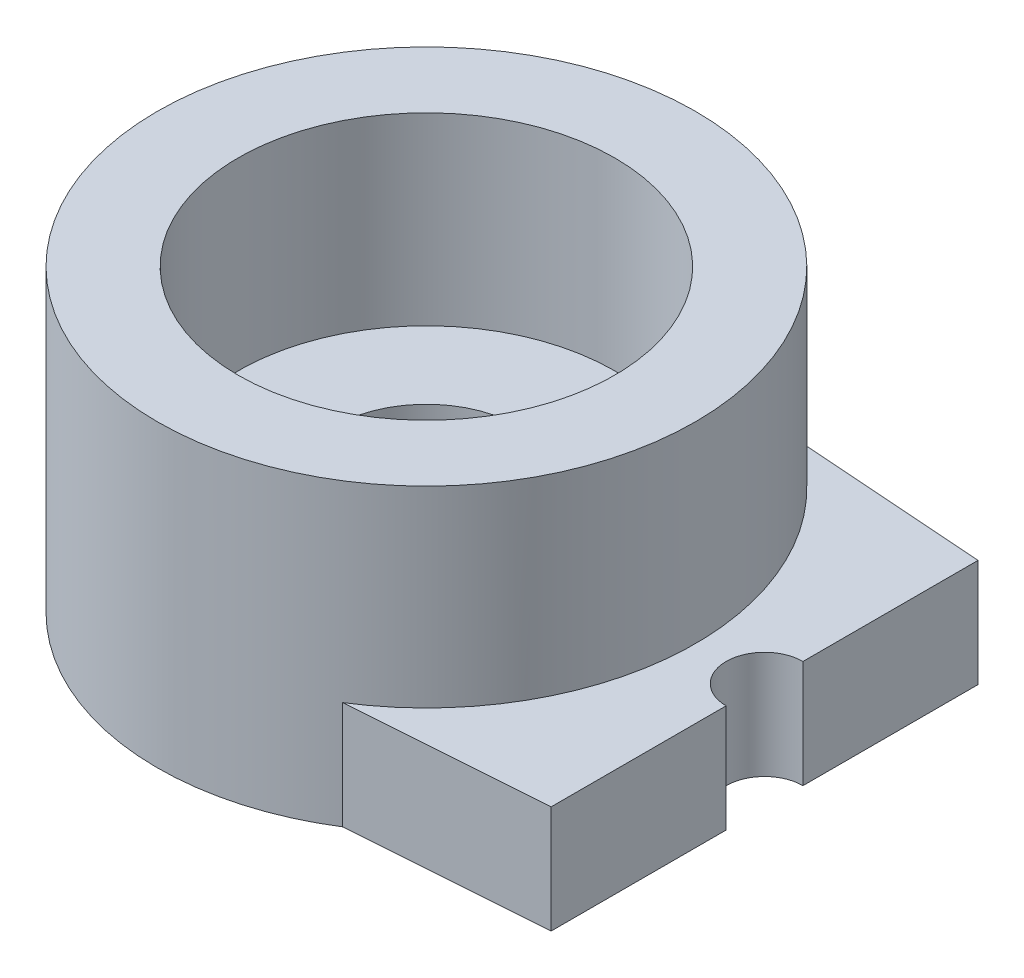
ISO-10303-21;
HEADER;
FILE_DESCRIPTION(('STEP AP214'),'2;1');
FILE_NAME('part.step','',(''),(''),'','','');
FILE_SCHEMA(('AUTOMOTIVE_DESIGN { 1 0 10303 214 1 1 1 1 }'));
ENDSEC;
DATA;
#1=APPLICATION_CONTEXT('core data for automotive mechanical design processes');
#2=APPLICATION_PROTOCOL_DEFINITION('international standard','automotive_design',2000,#1);
#3=PRODUCT_CONTEXT('',#1,'mechanical');
#4=PRODUCT('Part','Part','',(#3));
#5=PRODUCT_RELATED_PRODUCT_CATEGORY('part','',(#4));
#6=PRODUCT_DEFINITION_FORMATION('','',#4);
#7=PRODUCT_DEFINITION_CONTEXT('part definition',#1,'design');
#8=PRODUCT_DEFINITION('design','',#6,#7);
#9=PRODUCT_DEFINITION_SHAPE('','',#8);
#10=(LENGTH_UNIT() NAMED_UNIT(*) SI_UNIT(.MILLI.,.METRE.));
#11=(NAMED_UNIT(*) PLANE_ANGLE_UNIT() SI_UNIT($,.RADIAN.));
#12=(NAMED_UNIT(*) SI_UNIT($,.STERADIAN.) SOLID_ANGLE_UNIT());
#13=UNCERTAINTY_MEASURE_WITH_UNIT(LENGTH_MEASURE(1.E-05),#10,'distance_accuracy_value','');
#14=(GEOMETRIC_REPRESENTATION_CONTEXT(3) GLOBAL_UNCERTAINTY_ASSIGNED_CONTEXT((#13)) GLOBAL_UNIT_ASSIGNED_CONTEXT((#10,
#11,#12)) REPRESENTATION_CONTEXT('',''));
#15=CARTESIAN_POINT('',(0.,0.,0.));
#16=DIRECTION('',(0.,0.,1.));
#17=DIRECTION('',(1.,0.,0.));
#18=AXIS2_PLACEMENT_3D('',#15,#16,#17);
#19=CARTESIAN_POINT('',(15.2,3.9,2.));
#20=DIRECTION('',(0.0717840294641297,0.,0.997420198870011));
#21=DIRECTION('',(0.997420198870011,0.,-0.0717840294641297));
#22=AXIS2_PLACEMENT_3D('',#19,#20,#21);
#23=PLANE('',#22);
#24=DIRECTION('',(-0.997420198870011,0.,0.0717840294641296));
#25=VECTOR('',#24,1.);
#26=CARTESIAN_POINT('',(15.2,0.,2.));
#27=LINE('',#26,#25);
#28=CARTESIAN_POINT('',(4.4,0.,2.77727272727273));
#29=VERTEX_POINT('',#28);
#30=CARTESIAN_POINT('',(1.86858471289894,0.,2.95945791838985));
#31=VERTEX_POINT('',#30);
#32=EDGE_CURVE('E1068',#29,#31,#27,.T.);
#33=ORIENTED_EDGE('',*,*,#32,.F.);
#34=DIRECTION('',(0.,1.,0.));
#35=VECTOR('',#34,1.);
#36=CARTESIAN_POINT('',(4.4,3.9,2.77727272727273));
#37=LINE('',#36,#35);
#38=CARTESIAN_POINT('',(4.4,1.4,2.77727272727273));
#39=VERTEX_POINT('',#38);
#40=EDGE_CURVE('E1015',#29,#39,#37,.T.);
#41=ORIENTED_EDGE('',*,*,#40,.T.);
#42=DIRECTION('',(0.997420198870011,0.,-0.0717840294641297));
#43=VECTOR('',#42,1.);
#44=CARTESIAN_POINT('',(-14.9001527327747,1.4,4.16629887091939));
#45=LINE('',#44,#43);
#46=CARTESIAN_POINT('',(1.86858471289894,1.4,2.95945791838985));
#47=VERTEX_POINT('',#46);
#48=EDGE_CURVE('E1097',#47,#39,#45,.T.);
#49=ORIENTED_EDGE('',*,*,#48,.F.);
#50=DIRECTION('',(0.,-1.,0.));
#51=VECTOR('',#50,1.);
#52=CARTESIAN_POINT('',(1.86858471289894,3.9,2.95945791838985));
#53=LINE('',#52,#51);
#54=EDGE_CURVE('E1075',#47,#31,#53,.T.);
#55=ORIENTED_EDGE('',*,*,#54,.T.);
#56=EDGE_LOOP('',(#33,#41,#49,#55));
#57=FACE_BOUND('',#56,.T.);
#58=ADVANCED_FACE('F1006',(#57),#23,.T.);
#59=CARTESIAN_POINT('',(-15.2,1.4,0.));
#60=DIRECTION('',(0.,1.,0.));
#61=DIRECTION('',(0.,0.,1.));
#62=AXIS2_PLACEMENT_3D('',#59,#60,#61);
#63=PLANE('',#62);
#64=DIRECTION('',(0.,0.,1.));
#65=VECTOR('',#64,1.);
#66=CARTESIAN_POINT('',(4.4,1.4,0.));
#67=LINE('',#66,#65);
#68=CARTESIAN_POINT('',(4.4,1.4,-2.77727272727273));
#69=VERTEX_POINT('',#68);
#70=CARTESIAN_POINT('',(4.4,1.4,-0.499999999999929));
#71=VERTEX_POINT('',#70);
#72=EDGE_CURVE('E1085',#69,#71,#67,.T.);
#73=ORIENTED_EDGE('',*,*,#72,.F.);
#74=DIRECTION('',(-0.997420198870011,0.,-0.0717840294641295));
#75=VECTOR('',#74,1.);
#76=CARTESIAN_POINT('',(-14.9001527327747,1.4,-4.16629887091939));
#77=LINE('',#76,#75);
#78=CARTESIAN_POINT('',(1.86858471289894,1.4,-2.95945791838985));
#79=VERTEX_POINT('',#78);
#80=EDGE_CURVE('E1091',#69,#79,#77,.T.);
#81=ORIENTED_EDGE('',*,*,#80,.T.);
#82=CARTESIAN_POINT('',(0.,1.4,0.));
#83=DIRECTION('',(0.,1.,0.));
#84=DIRECTION('',(0.,0.,1.));
#85=AXIS2_PLACEMENT_3D('',#82,#83,#84);
#86=CIRCLE('',#85,3.5);
#87=EDGE_CURVE('E1109',#47,#79,#86,.T.);
#88=ORIENTED_EDGE('',*,*,#87,.F.);
#89=ORIENTED_EDGE('',*,*,#48,.T.);
#90=DIRECTION('',(0.,0.,-1.));
#91=VECTOR('',#90,1.);
#92=CARTESIAN_POINT('',(4.4,1.4,0.));
#93=LINE('',#92,#91);
#94=CARTESIAN_POINT('',(4.4,1.4,0.500000000000066));
#95=VERTEX_POINT('',#94);
#96=EDGE_CURVE('E1029',#39,#95,#93,.T.);
#97=ORIENTED_EDGE('',*,*,#96,.T.);
#98=CARTESIAN_POINT('',(4.4,1.4,0.));
#99=DIRECTION('',(0.,1.,0.));
#100=DIRECTION('',(0.,0.,1.));
#101=AXIS2_PLACEMENT_3D('',#98,#99,#100);
#102=CIRCLE('',#101,0.499999999999997);
#103=EDGE_CURVE('E1125',#71,#95,#102,.T.);
#104=ORIENTED_EDGE('',*,*,#103,.F.);
#105=EDGE_LOOP('',(#73,#81,#88,#89,#97,#104));
#106=FACE_BOUND('',#105,.T.);
#107=ADVANCED_FACE('F1164',(#106),#63,.T.);
#108=CARTESIAN_POINT('',(-15.2,0.,0.));
#109=DIRECTION('',(0.,1.,0.));
#110=DIRECTION('',(0.,0.,1.));
#111=AXIS2_PLACEMENT_3D('',#108,#109,#110);
#112=PLANE('',#111);
#113=CARTESIAN_POINT('',(0.,0.,0.));
#114=DIRECTION('',(0.,-1.,0.));
#115=DIRECTION('',(0.,0.,-1.));
#116=AXIS2_PLACEMENT_3D('',#113,#114,#115);
#117=CIRCLE('',#116,2.35);
#118=CARTESIAN_POINT('',(0.,0.,-2.35));
#119=VERTEX_POINT('',#118);
#120=EDGE_CURVE('E1114',#119,#119,#117,.T.);
#121=ORIENTED_EDGE('',*,*,#120,.F.);
#122=EDGE_LOOP('',(#121));
#123=FACE_BOUND('',#122,.T.);
#124=DIRECTION('',(0.997420198870011,0.,0.0717840294641295));
#125=VECTOR('',#124,1.);
#126=CARTESIAN_POINT('',(1.86858471289894,0.,-2.95945791838985));
#127=LINE('',#126,#125);
#128=CARTESIAN_POINT('',(1.86858471289894,0.,-2.95945791838985));
#129=VERTEX_POINT('',#128);
#130=CARTESIAN_POINT('',(4.4,0.,-2.77727272727273));
#131=VERTEX_POINT('',#130);
#132=EDGE_CURVE('E1079',#129,#131,#127,.T.);
#133=ORIENTED_EDGE('',*,*,#132,.T.);
#134=DIRECTION('',(0.,0.,-1.));
#135=VECTOR('',#134,1.);
#136=CARTESIAN_POINT('',(4.4,0.,0.));
#137=LINE('',#136,#135);
#138=CARTESIAN_POINT('',(4.4,0.,-0.499999999999929));
#139=VERTEX_POINT('',#138);
#140=EDGE_CURVE('E1021',#139,#131,#137,.T.);
#141=ORIENTED_EDGE('',*,*,#140,.F.);
#142=CARTESIAN_POINT('',(4.4,0.,0.));
#143=DIRECTION('',(0.,1.,0.));
#144=DIRECTION('',(0.,0.,1.));
#145=AXIS2_PLACEMENT_3D('',#142,#143,#144);
#146=CIRCLE('',#145,0.499999999999997);
#147=CARTESIAN_POINT('',(4.4,0.,0.500000000000066));
#148=VERTEX_POINT('',#147);
#149=EDGE_CURVE('E1071',#139,#148,#146,.T.);
#150=ORIENTED_EDGE('',*,*,#149,.T.);
#151=DIRECTION('',(0.,0.,1.));
#152=VECTOR('',#151,1.);
#153=CARTESIAN_POINT('',(4.4,0.,0.));
#154=LINE('',#153,#152);
#155=EDGE_CURVE('E1058',#148,#29,#154,.T.);
#156=ORIENTED_EDGE('',*,*,#155,.T.);
#157=ORIENTED_EDGE('',*,*,#32,.T.);
#158=CARTESIAN_POINT('',(0.,0.,0.));
#159=DIRECTION('',(0.,-1.,0.));
#160=DIRECTION('',(0.,0.,-1.));
#161=AXIS2_PLACEMENT_3D('',#158,#159,#160);
#162=CIRCLE('',#161,3.5);
#163=EDGE_CURVE('E1078',#31,#129,#162,.T.);
#164=ORIENTED_EDGE('',*,*,#163,.T.);
#165=EDGE_LOOP('',(#133,#141,#150,#156,#157,#164));
#166=FACE_BOUND('',#165,.T.);
#167=ADVANCED_FACE('F1008',(#123,#166),#112,.F.);
#168=CARTESIAN_POINT('',(4.4,1.4,0.));
#169=DIRECTION('',(0.,-1.,0.));
#170=DIRECTION('',(0.,0.,-1.));
#171=AXIS2_PLACEMENT_3D('',#168,#169,#170);
#172=CYLINDRICAL_SURFACE('',#171,0.499999999999997);
#173=DIRECTION('',(0.,-1.,0.));
#174=VECTOR('',#173,1.);
#175=CARTESIAN_POINT('',(4.4,10.,-0.499999999999929));
#176=LINE('',#175,#174);
#177=EDGE_CURVE('E1205',#71,#139,#176,.T.);
#178=ORIENTED_EDGE('',*,*,#177,.F.);
#179=ORIENTED_EDGE('',*,*,#103,.T.);
#180=DIRECTION('',(0.,-1.,0.));
#181=VECTOR('',#180,1.);
#182=CARTESIAN_POINT('',(4.4,10.,0.500000000000066));
#183=LINE('',#182,#181);
#184=EDGE_CURVE('E1208',#95,#148,#183,.T.);
#185=ORIENTED_EDGE('',*,*,#184,.T.);
#186=ORIENTED_EDGE('',*,*,#149,.F.);
#187=EDGE_LOOP('',(#178,#179,#185,#186));
#188=FACE_BOUND('',#187,.T.);
#189=ADVANCED_FACE('F1192',(#188),#172,.F.);
#190=CARTESIAN_POINT('',(0.,1.,0.));
#191=DIRECTION('',(0.,-1.,0.));
#192=DIRECTION('',(0.,0.,-1.));
#193=AXIS2_PLACEMENT_3D('',#190,#191,#192);
#194=CYLINDRICAL_SURFACE('',#193,2.35);
#195=CARTESIAN_POINT('',(0.,1.,0.));
#196=DIRECTION('',(0.,-1.,0.));
#197=DIRECTION('',(0.,0.,-1.));
#198=AXIS2_PLACEMENT_3D('',#195,#196,#197);
#199=CIRCLE('',#198,2.35);
#200=CARTESIAN_POINT('',(0.,1.,-2.35));
#201=VERTEX_POINT('',#200);
#202=EDGE_CURVE('E1118',#201,#201,#199,.T.);
#203=ORIENTED_EDGE('',*,*,#202,.F.);
#204=EDGE_LOOP('',(#203));
#205=FACE_BOUND('',#204,.T.);
#206=ORIENTED_EDGE('',*,*,#120,.T.);
#207=EDGE_LOOP('',(#206));
#208=FACE_BOUND('',#207,.T.);
#209=ADVANCED_FACE('F1160',(#205,#208),#194,.F.);
#210=CARTESIAN_POINT('',(0.,1.,0.));
#211=DIRECTION('',(0.,-1.,0.));
#212=DIRECTION('',(0.,0.,-1.));
#213=AXIS2_PLACEMENT_3D('',#210,#211,#212);
#214=PLANE('',#213);
#215=CARTESIAN_POINT('',(0.,1.,0.));
#216=DIRECTION('',(0.,-1.,0.));
#217=DIRECTION('',(0.,0.,-1.));
#218=AXIS2_PLACEMENT_3D('',#215,#216,#217);
#219=CIRCLE('',#218,1.2);
#220=CARTESIAN_POINT('',(0.,1.,-1.2));
#221=VERTEX_POINT('',#220);
#222=EDGE_CURVE('E1104',#221,#221,#219,.T.);
#223=ORIENTED_EDGE('',*,*,#222,.F.);
#224=EDGE_LOOP('',(#223));
#225=FACE_BOUND('',#224,.T.);
#226=ORIENTED_EDGE('',*,*,#202,.T.);
#227=EDGE_LOOP('',(#226));
#228=FACE_BOUND('',#227,.T.);
#229=ADVANCED_FACE('F1151',(#225,#228),#214,.T.);
#230=CARTESIAN_POINT('',(0.,3.9,0.));
#231=DIRECTION('',(0.,1.,0.));
#232=DIRECTION('',(0.,0.,1.));
#233=AXIS2_PLACEMENT_3D('',#230,#231,#232);
#234=PLANE('',#233);
#235=CARTESIAN_POINT('',(0.,3.9,0.));
#236=DIRECTION('',(0.,1.,0.));
#237=DIRECTION('',(0.,0.,1.));
#238=AXIS2_PLACEMENT_3D('',#235,#236,#237);
#239=CIRCLE('',#238,3.5);
#240=CARTESIAN_POINT('',(0.,3.9,3.5));
#241=VERTEX_POINT('',#240);
#242=EDGE_CURVE('E1110',#241,#241,#239,.T.);
#243=ORIENTED_EDGE('',*,*,#242,.T.);
#244=EDGE_LOOP('',(#243));
#245=FACE_BOUND('',#244,.T.);
#246=CARTESIAN_POINT('',(0.,3.9,0.));
#247=DIRECTION('',(0.,1.,0.));
#248=DIRECTION('',(0.,0.,1.));
#249=AXIS2_PLACEMENT_3D('',#246,#247,#248);
#250=CIRCLE('',#249,2.45);
#251=CARTESIAN_POINT('',(0.,3.9,2.45));
#252=VERTEX_POINT('',#251);
#253=EDGE_CURVE('E1105',#252,#252,#250,.T.);
#254=ORIENTED_EDGE('',*,*,#253,.F.);
#255=EDGE_LOOP('',(#254));
#256=FACE_BOUND('',#255,.T.);
#257=ADVANCED_FACE('F1149',(#245,#256),#234,.T.);
#258=CARTESIAN_POINT('',(0.,3.9,0.));
#259=DIRECTION('',(0.,-1.,0.));
#260=DIRECTION('',(0.,0.,-1.));
#261=AXIS2_PLACEMENT_3D('',#258,#259,#260);
#262=CYLINDRICAL_SURFACE('',#261,3.5);
#263=DIRECTION('',(0.,-1.,0.));
#264=VECTOR('',#263,1.);
#265=CARTESIAN_POINT('',(1.86858471289894,3.9,-2.95945791838985));
#266=LINE('',#265,#264);
#267=EDGE_CURVE('E1083',#79,#129,#266,.T.);
#268=ORIENTED_EDGE('',*,*,#267,.T.);
#269=ORIENTED_EDGE('',*,*,#163,.F.);
#270=ORIENTED_EDGE('',*,*,#54,.F.);
#271=ORIENTED_EDGE('',*,*,#87,.T.);
#272=EDGE_LOOP('',(#268,#269,#270,#271));
#273=FACE_BOUND('',#272,.T.);
#274=ORIENTED_EDGE('',*,*,#242,.F.);
#275=EDGE_LOOP('',(#274));
#276=FACE_BOUND('',#275,.T.);
#277=ADVANCED_FACE('F1145',(#273,#276),#262,.T.);
#278=CARTESIAN_POINT('',(0.,3.9,0.));
#279=DIRECTION('',(0.,-1.,0.));
#280=DIRECTION('',(0.,0.,-1.));
#281=AXIS2_PLACEMENT_3D('',#278,#279,#280);
#282=CYLINDRICAL_SURFACE('',#281,2.45);
#283=CARTESIAN_POINT('',(0.,1.5,0.));
#284=DIRECTION('',(0.,1.,0.));
#285=DIRECTION('',(0.,0.,1.));
#286=AXIS2_PLACEMENT_3D('',#283,#284,#285);
#287=CIRCLE('',#286,2.45);
#288=CARTESIAN_POINT('',(0.,1.5,2.45));
#289=VERTEX_POINT('',#288);
#290=EDGE_CURVE('E1064',#289,#289,#287,.T.);
#291=ORIENTED_EDGE('',*,*,#290,.F.);
#292=EDGE_LOOP('',(#291));
#293=FACE_BOUND('',#292,.T.);
#294=ORIENTED_EDGE('',*,*,#253,.T.);
#295=EDGE_LOOP('',(#294));
#296=FACE_BOUND('',#295,.T.);
#297=ADVANCED_FACE('F1141',(#293,#296),#282,.F.);
#298=CARTESIAN_POINT('',(0.,0.,0.));
#299=DIRECTION('',(0.,1.,0.));
#300=DIRECTION('',(0.,0.,1.));
#301=AXIS2_PLACEMENT_3D('',#298,#299,#300);
#302=CYLINDRICAL_SURFACE('',#301,1.2);
#303=ORIENTED_EDGE('',*,*,#222,.T.);
#304=EDGE_LOOP('',(#303));
#305=FACE_BOUND('',#304,.T.);
#306=CARTESIAN_POINT('',(0.,1.5,0.));
#307=DIRECTION('',(0.,1.,0.));
#308=DIRECTION('',(0.,0.,1.));
#309=AXIS2_PLACEMENT_3D('',#306,#307,#308);
#310=CIRCLE('',#309,1.2);
#311=CARTESIAN_POINT('',(0.,1.5,1.2));
#312=VERTEX_POINT('',#311);
#313=EDGE_CURVE('E1100',#312,#312,#310,.T.);
#314=ORIENTED_EDGE('',*,*,#313,.T.);
#315=EDGE_LOOP('',(#314));
#316=FACE_BOUND('',#315,.T.);
#317=ADVANCED_FACE('F1144',(#305,#316),#302,.F.);
#318=CARTESIAN_POINT('',(0.,1.5,0.));
#319=DIRECTION('',(0.,1.,0.));
#320=DIRECTION('',(0.,0.,1.));
#321=AXIS2_PLACEMENT_3D('',#318,#319,#320);
#322=PLANE('',#321);
#323=ORIENTED_EDGE('',*,*,#290,.T.);
#324=EDGE_LOOP('',(#323));
#325=FACE_BOUND('',#324,.T.);
#326=ORIENTED_EDGE('',*,*,#313,.F.);
#327=EDGE_LOOP('',(#326));
#328=FACE_BOUND('',#327,.T.);
#329=ADVANCED_FACE('F1138',(#325,#328),#322,.T.);
#330=CARTESIAN_POINT('',(1.86858471289894,3.9,-2.95945791838985));
#331=DIRECTION('',(0.0717840294641295,0.,-0.997420198870011));
#332=DIRECTION('',(-0.997420198870011,0.,-0.0717840294641295));
#333=AXIS2_PLACEMENT_3D('',#330,#331,#332);
#334=PLANE('',#333);
#335=DIRECTION('',(0.,1.,0.));
#336=VECTOR('',#335,1.);
#337=CARTESIAN_POINT('',(4.4,3.9,-2.77727272727273));
#338=LINE('',#337,#336);
#339=EDGE_CURVE('E12',#131,#69,#338,.T.);
#340=ORIENTED_EDGE('',*,*,#339,.F.);
#341=ORIENTED_EDGE('',*,*,#132,.F.);
#342=ORIENTED_EDGE('',*,*,#267,.F.);
#343=ORIENTED_EDGE('',*,*,#80,.F.);
#344=EDGE_LOOP('',(#340,#341,#342,#343));
#345=FACE_BOUND('',#344,.T.);
#346=ADVANCED_FACE('F1174',(#345),#334,.T.);
#347=CARTESIAN_POINT('',(4.4,10.,0.));
#348=DIRECTION('',(1.,0.,0.));
#349=DIRECTION('',(0.,0.,-1.));
#350=AXIS2_PLACEMENT_3D('',#347,#348,#349);
#351=PLANE('',#350);
#352=ORIENTED_EDGE('',*,*,#40,.F.);
#353=ORIENTED_EDGE('',*,*,#155,.F.);
#354=ORIENTED_EDGE('',*,*,#184,.F.);
#355=ORIENTED_EDGE('',*,*,#96,.F.);
#356=EDGE_LOOP('',(#352,#353,#354,#355));
#357=FACE_BOUND('',#356,.T.);
#358=ADVANCED_FACE('F1057',(#357),#351,.T.);
#359=CARTESIAN_POINT('',(4.4,10.,0.));
#360=DIRECTION('',(-1.,0.,0.));
#361=DIRECTION('',(0.,0.,1.));
#362=AXIS2_PLACEMENT_3D('',#359,#360,#361);
#363=PLANE('',#362);
#364=ORIENTED_EDGE('',*,*,#72,.T.);
#365=ORIENTED_EDGE('',*,*,#177,.T.);
#366=ORIENTED_EDGE('',*,*,#140,.T.);
#367=ORIENTED_EDGE('',*,*,#339,.T.);
#368=EDGE_LOOP('',(#364,#365,#366,#367));
#369=FACE_BOUND('',#368,.T.);
#370=ADVANCED_FACE('F1220',(#369),#363,.F.);
#371=CLOSED_SHELL('',(#58,#107,#167,#189,#209,#229,#257,#277,#297,#317,#329,#346,#358,#370));
#372=MANIFOLD_SOLID_BREP('B2',#371);
#373=ADVANCED_BREP_SHAPE_REPRESENTATION('',(#18,#372),#14);
#374=SHAPE_DEFINITION_REPRESENTATION(#9,#373);
ENDSEC;
END-ISO-10303-21;
